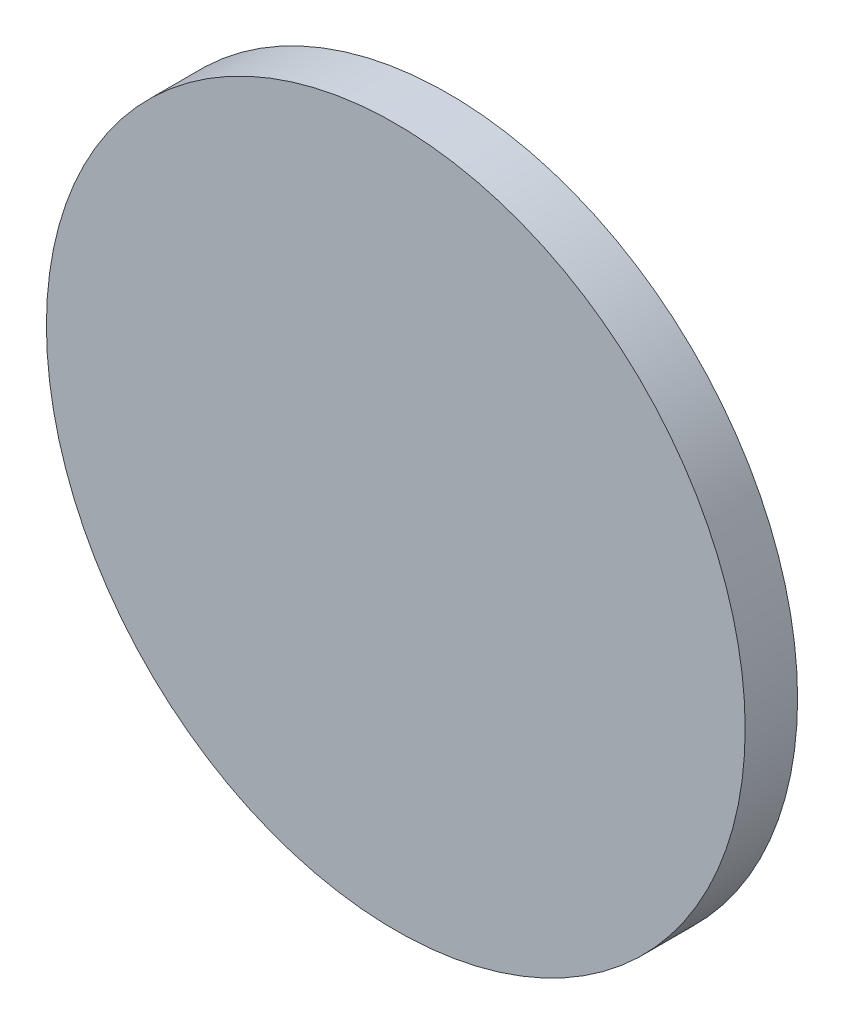
ISO-10303-21;
HEADER;
FILE_DESCRIPTION(('STEP AP214'),'2;1');
FILE_NAME('part.step','',(''),(''),'','','');
FILE_SCHEMA(('AUTOMOTIVE_DESIGN { 1 0 10303 214 1 1 1 1 }'));
ENDSEC;
DATA;
#1=APPLICATION_CONTEXT('core data for automotive mechanical design processes');
#2=APPLICATION_PROTOCOL_DEFINITION('international standard','automotive_design',2000,#1);
#3=PRODUCT_CONTEXT('',#1,'mechanical');
#4=PRODUCT('Part','Part','',(#3));
#5=PRODUCT_RELATED_PRODUCT_CATEGORY('part','',(#4));
#6=PRODUCT_DEFINITION_FORMATION('','',#4);
#7=PRODUCT_DEFINITION_CONTEXT('part definition',#1,'design');
#8=PRODUCT_DEFINITION('design','',#6,#7);
#9=PRODUCT_DEFINITION_SHAPE('','',#8);
#10=(LENGTH_UNIT() NAMED_UNIT(*) SI_UNIT(.MILLI.,.METRE.));
#11=(NAMED_UNIT(*) PLANE_ANGLE_UNIT() SI_UNIT($,.RADIAN.));
#12=(NAMED_UNIT(*) SI_UNIT($,.STERADIAN.) SOLID_ANGLE_UNIT());
#13=UNCERTAINTY_MEASURE_WITH_UNIT(LENGTH_MEASURE(1.E-05),#10,'distance_accuracy_value','');
#14=(GEOMETRIC_REPRESENTATION_CONTEXT(3) GLOBAL_UNCERTAINTY_ASSIGNED_CONTEXT((#13)) GLOBAL_UNIT_ASSIGNED_CONTEXT((#10,
#11,#12)) REPRESENTATION_CONTEXT('',''));
#15=CARTESIAN_POINT('',(0.,0.,0.));
#16=DIRECTION('',(0.,0.,1.));
#17=DIRECTION('',(1.,0.,0.));
#18=AXIS2_PLACEMENT_3D('',#15,#16,#17);
#19=CARTESIAN_POINT('',(10.44416,13.13491,0.03429));
#20=DIRECTION('',(0.,0.,1.));
#21=DIRECTION('',(1.,0.,0.));
#22=AXIS2_PLACEMENT_3D('',#19,#20,#21);
#23=PLANE('',#22);
#24=CARTESIAN_POINT('',(10.44416,13.13491,0.03429));
#25=DIRECTION('',(0.,0.,1.));
#26=DIRECTION('',(1.,0.,0.));
#27=AXIS2_PLACEMENT_3D('',#24,#25,#26);
#28=CIRCLE('',#27,0.2286);
#29=CARTESIAN_POINT('',(10.67276,13.13491,0.03429));
#30=VERTEX_POINT('',#29);
#31=EDGE_CURVE('E18',#30,#30,#28,.F.);
#32=ORIENTED_EDGE('',*,*,#31,.F.);
#33=EDGE_LOOP('',(#32));
#34=FACE_BOUND('',#33,.T.);
#35=ADVANCED_FACE('F15',(#34),#23,.T.);
#36=CARTESIAN_POINT('',(10.44416,13.13491,0.));
#37=DIRECTION('',(0.,0.,1.));
#38=DIRECTION('',(1.,0.,0.));
#39=AXIS2_PLACEMENT_3D('',#36,#37,#38);
#40=CYLINDRICAL_SURFACE('',#39,0.2286);
#41=ORIENTED_EDGE('',*,*,#31,.T.);
#42=EDGE_LOOP('',(#41));
#43=FACE_BOUND('',#42,.T.);
#44=CARTESIAN_POINT('',(10.44416,13.13491,0.));
#45=DIRECTION('',(0.,0.,1.));
#46=DIRECTION('',(1.,0.,0.));
#47=AXIS2_PLACEMENT_3D('',#44,#45,#46);
#48=CIRCLE('',#47,0.2286);
#49=CARTESIAN_POINT('',(10.67276,13.13491,0.));
#50=VERTEX_POINT('',#49);
#51=EDGE_CURVE('E10',#50,#50,#48,.F.);
#52=ORIENTED_EDGE('',*,*,#51,.F.);
#53=EDGE_LOOP('',(#52));
#54=FACE_BOUND('',#53,.T.);
#55=ADVANCED_FACE('F27',(#43,#54),#40,.T.);
#56=CARTESIAN_POINT('',(10.44416,13.13491,0.));
#57=DIRECTION('',(0.,0.,-1.));
#58=DIRECTION('',(-1.,0.,0.));
#59=AXIS2_PLACEMENT_3D('',#56,#57,#58);
#60=PLANE('',#59);
#61=ORIENTED_EDGE('',*,*,#51,.T.);
#62=EDGE_LOOP('',(#61));
#63=FACE_BOUND('',#62,.T.);
#64=ADVANCED_FACE('F35',(#63),#60,.T.);
#65=CLOSED_SHELL('',(#35,#55,#64));
#66=MANIFOLD_SOLID_BREP('B1',#65);
#67=ADVANCED_BREP_SHAPE_REPRESENTATION('',(#18,#66),#14);
#68=SHAPE_DEFINITION_REPRESENTATION(#9,#67);
ENDSEC;
END-ISO-10303-21;
